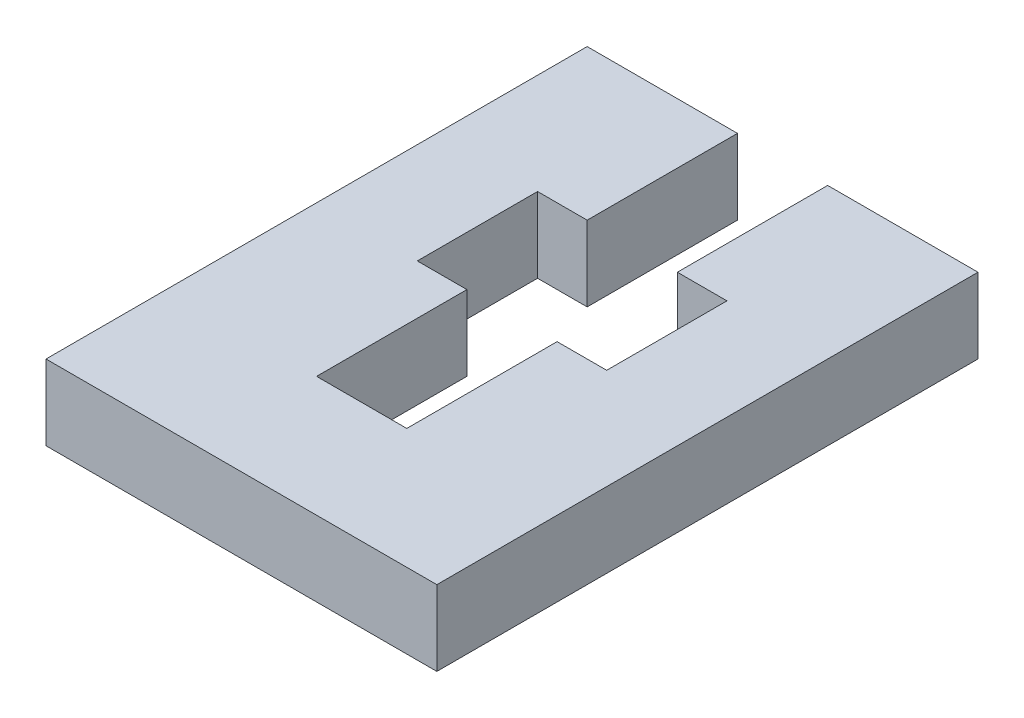
ISO-10303-21;
HEADER;
FILE_DESCRIPTION(('STEP AP214'),'2;1');
FILE_NAME('part.step','',(''),(''),'','','');
FILE_SCHEMA(('AUTOMOTIVE_DESIGN { 1 0 10303 214 1 1 1 1 }'));
ENDSEC;
DATA;
#1=APPLICATION_CONTEXT('core data for automotive mechanical design processes');
#2=APPLICATION_PROTOCOL_DEFINITION('international standard','automotive_design',2000,#1);
#3=PRODUCT_CONTEXT('',#1,'mechanical');
#4=PRODUCT('Part','Part','',(#3));
#5=PRODUCT_RELATED_PRODUCT_CATEGORY('part','',(#4));
#6=PRODUCT_DEFINITION_FORMATION('','',#4);
#7=PRODUCT_DEFINITION_CONTEXT('part definition',#1,'design');
#8=PRODUCT_DEFINITION('design','',#6,#7);
#9=PRODUCT_DEFINITION_SHAPE('','',#8);
#10=(LENGTH_UNIT() NAMED_UNIT(*) SI_UNIT(.MILLI.,.METRE.));
#11=(NAMED_UNIT(*) PLANE_ANGLE_UNIT() SI_UNIT($,.RADIAN.));
#12=(NAMED_UNIT(*) SI_UNIT($,.STERADIAN.) SOLID_ANGLE_UNIT());
#13=UNCERTAINTY_MEASURE_WITH_UNIT(LENGTH_MEASURE(1.E-05),#10,'distance_accuracy_value','');
#14=(GEOMETRIC_REPRESENTATION_CONTEXT(3) GLOBAL_UNCERTAINTY_ASSIGNED_CONTEXT((#13)) GLOBAL_UNIT_ASSIGNED_CONTEXT((#10,
#11,#12)) REPRESENTATION_CONTEXT('',''));
#15=CARTESIAN_POINT('',(0.,0.,0.));
#16=DIRECTION('',(0.,0.,1.));
#17=DIRECTION('',(1.,0.,0.));
#18=AXIS2_PLACEMENT_3D('',#15,#16,#17);
#19=CARTESIAN_POINT('',(6.5,2.5,-8.5));
#20=DIRECTION('',(0.,0.,1.));
#21=DIRECTION('',(1.,0.,0.));
#22=AXIS2_PLACEMENT_3D('',#19,#20,#21);
#23=PLANE('',#22);
#24=DIRECTION('',(-1.,0.,0.));
#25=VECTOR('',#24,1.);
#26=CARTESIAN_POINT('',(6.5,0.,-8.5));
#27=LINE('',#26,#25);
#28=CARTESIAN_POINT('',(6.5,0.,-8.5));
#29=VERTEX_POINT('',#28);
#30=CARTESIAN_POINT('',(1.5,0.,-8.5));
#31=VERTEX_POINT('',#30);
#32=EDGE_CURVE('E177',#29,#31,#27,.T.);
#33=ORIENTED_EDGE('',*,*,#32,.T.);
#34=DIRECTION('',(0.,-1.,0.));
#35=VECTOR('',#34,1.);
#36=CARTESIAN_POINT('',(1.5,2.5,-8.5));
#37=LINE('',#36,#35);
#38=CARTESIAN_POINT('',(1.5,2.5,-8.5));
#39=VERTEX_POINT('',#38);
#40=EDGE_CURVE('E11',#39,#31,#37,.T.);
#41=ORIENTED_EDGE('',*,*,#40,.F.);
#42=DIRECTION('',(-1.,0.,0.));
#43=VECTOR('',#42,1.);
#44=CARTESIAN_POINT('',(6.5,2.5,-8.5));
#45=LINE('',#44,#43);
#46=CARTESIAN_POINT('',(6.5,2.5,-8.5));
#47=VERTEX_POINT('',#46);
#48=EDGE_CURVE('E207',#47,#39,#45,.T.);
#49=ORIENTED_EDGE('',*,*,#48,.F.);
#50=DIRECTION('',(0.,-1.,0.));
#51=VECTOR('',#50,1.);
#52=CARTESIAN_POINT('',(6.5,2.5,-8.5));
#53=LINE('',#52,#51);
#54=EDGE_CURVE('E173',#47,#29,#53,.T.);
#55=ORIENTED_EDGE('',*,*,#54,.T.);
#56=EDGE_LOOP('',(#33,#41,#49,#55));
#57=FACE_BOUND('',#56,.T.);
#58=ADVANCED_FACE('F33',(#57),#23,.F.);
#59=CARTESIAN_POINT('',(1.5,2.5,-8.5));
#60=DIRECTION('',(1.,0.,0.));
#61=DIRECTION('',(0.,0.,-1.));
#62=AXIS2_PLACEMENT_3D('',#59,#60,#61);
#63=PLANE('',#62);
#64=DIRECTION('',(0.,0.,1.));
#65=VECTOR('',#64,1.);
#66=CARTESIAN_POINT('',(1.5,0.,-8.5));
#67=LINE('',#66,#65);
#68=CARTESIAN_POINT('',(1.5,0.,-3.5));
#69=VERTEX_POINT('',#68);
#70=EDGE_CURVE('E180',#31,#69,#67,.T.);
#71=ORIENTED_EDGE('',*,*,#70,.T.);
#72=DIRECTION('',(0.,-1.,0.));
#73=VECTOR('',#72,1.);
#74=CARTESIAN_POINT('',(1.5,2.5,-3.5));
#75=LINE('',#74,#73);
#76=CARTESIAN_POINT('',(1.5,2.5,-3.5));
#77=VERTEX_POINT('',#76);
#78=EDGE_CURVE('E41',#77,#69,#75,.T.);
#79=ORIENTED_EDGE('',*,*,#78,.F.);
#80=DIRECTION('',(0.,0.,1.));
#81=VECTOR('',#80,1.);
#82=CARTESIAN_POINT('',(1.5,2.5,-8.5));
#83=LINE('',#82,#81);
#84=EDGE_CURVE('E116',#39,#77,#83,.T.);
#85=ORIENTED_EDGE('',*,*,#84,.F.);
#86=ORIENTED_EDGE('',*,*,#40,.T.);
#87=EDGE_LOOP('',(#71,#79,#85,#86));
#88=FACE_BOUND('',#87,.T.);
#89=ADVANCED_FACE('F305',(#88),#63,.F.);
#90=CARTESIAN_POINT('',(1.5,2.5,-3.5));
#91=DIRECTION('',(0.,0.,-1.));
#92=DIRECTION('',(-1.,0.,0.));
#93=AXIS2_PLACEMENT_3D('',#90,#91,#92);
#94=PLANE('',#93);
#95=DIRECTION('',(1.,0.,0.));
#96=VECTOR('',#95,1.);
#97=CARTESIAN_POINT('',(1.5,0.,-3.5));
#98=LINE('',#97,#96);
#99=CARTESIAN_POINT('',(3.15,0.,-3.5));
#100=VERTEX_POINT('',#99);
#101=EDGE_CURVE('E182',#69,#100,#98,.T.);
#102=ORIENTED_EDGE('',*,*,#101,.T.);
#103=DIRECTION('',(0.,-1.,0.));
#104=VECTOR('',#103,1.);
#105=CARTESIAN_POINT('',(3.15,2.5,-3.5));
#106=LINE('',#105,#104);
#107=CARTESIAN_POINT('',(3.15,2.5,-3.5));
#108=VERTEX_POINT('',#107);
#109=EDGE_CURVE('E238',#108,#100,#106,.T.);
#110=ORIENTED_EDGE('',*,*,#109,.F.);
#111=DIRECTION('',(1.,0.,0.));
#112=VECTOR('',#111,1.);
#113=CARTESIAN_POINT('',(1.5,2.5,-3.5));
#114=LINE('',#113,#112);
#115=EDGE_CURVE('E246',#77,#108,#114,.T.);
#116=ORIENTED_EDGE('',*,*,#115,.F.);
#117=ORIENTED_EDGE('',*,*,#78,.T.);
#118=EDGE_LOOP('',(#102,#110,#116,#117));
#119=FACE_BOUND('',#118,.T.);
#120=ADVANCED_FACE('F244',(#119),#94,.F.);
#121=CARTESIAN_POINT('',(3.15,2.5,-3.5));
#122=DIRECTION('',(1.,0.,0.));
#123=DIRECTION('',(0.,0.,-1.));
#124=AXIS2_PLACEMENT_3D('',#121,#122,#123);
#125=PLANE('',#124);
#126=DIRECTION('',(0.,0.,1.));
#127=VECTOR('',#126,1.);
#128=CARTESIAN_POINT('',(3.15,0.,-3.5));
#129=LINE('',#128,#127);
#130=CARTESIAN_POINT('',(3.15,0.,0.5));
#131=VERTEX_POINT('',#130);
#132=EDGE_CURVE('E184',#100,#131,#129,.T.);
#133=ORIENTED_EDGE('',*,*,#132,.T.);
#134=DIRECTION('',(0.,-1.,0.));
#135=VECTOR('',#134,1.);
#136=CARTESIAN_POINT('',(3.15,2.5,0.5));
#137=LINE('',#136,#135);
#138=CARTESIAN_POINT('',(3.15,2.5,0.5));
#139=VERTEX_POINT('',#138);
#140=EDGE_CURVE('E235',#139,#131,#137,.T.);
#141=ORIENTED_EDGE('',*,*,#140,.F.);
#142=DIRECTION('',(0.,0.,1.));
#143=VECTOR('',#142,1.);
#144=CARTESIAN_POINT('',(3.15,2.5,-3.5));
#145=LINE('',#144,#143);
#146=EDGE_CURVE('E264',#108,#139,#145,.T.);
#147=ORIENTED_EDGE('',*,*,#146,.F.);
#148=ORIENTED_EDGE('',*,*,#109,.T.);
#149=EDGE_LOOP('',(#133,#141,#147,#148));
#150=FACE_BOUND('',#149,.T.);
#151=ADVANCED_FACE('F255',(#150),#125,.F.);
#152=CARTESIAN_POINT('',(3.15,2.5,0.5));
#153=DIRECTION('',(0.,0.,1.));
#154=DIRECTION('',(1.,0.,0.));
#155=AXIS2_PLACEMENT_3D('',#152,#153,#154);
#156=PLANE('',#155);
#157=DIRECTION('',(-1.,0.,0.));
#158=VECTOR('',#157,1.);
#159=CARTESIAN_POINT('',(3.15,0.,0.5));
#160=LINE('',#159,#158);
#161=CARTESIAN_POINT('',(1.5,0.,0.5));
#162=VERTEX_POINT('',#161);
#163=EDGE_CURVE('E186',#131,#162,#160,.T.);
#164=ORIENTED_EDGE('',*,*,#163,.T.);
#165=DIRECTION('',(0.,-1.,0.));
#166=VECTOR('',#165,1.);
#167=CARTESIAN_POINT('',(1.5,2.5,0.5));
#168=LINE('',#167,#166);
#169=CARTESIAN_POINT('',(1.5,2.5,0.5));
#170=VERTEX_POINT('',#169);
#171=EDGE_CURVE('E232',#170,#162,#168,.T.);
#172=ORIENTED_EDGE('',*,*,#171,.F.);
#173=DIRECTION('',(-1.,0.,0.));
#174=VECTOR('',#173,1.);
#175=CARTESIAN_POINT('',(3.15,2.5,0.5));
#176=LINE('',#175,#174);
#177=EDGE_CURVE('E261',#139,#170,#176,.T.);
#178=ORIENTED_EDGE('',*,*,#177,.F.);
#179=ORIENTED_EDGE('',*,*,#140,.T.);
#180=EDGE_LOOP('',(#164,#172,#178,#179));
#181=FACE_BOUND('',#180,.T.);
#182=ADVANCED_FACE('F259',(#181),#156,.F.);
#183=CARTESIAN_POINT('',(1.5,2.5,0.5));
#184=DIRECTION('',(1.,0.,0.));
#185=DIRECTION('',(0.,0.,-1.));
#186=AXIS2_PLACEMENT_3D('',#183,#184,#185);
#187=PLANE('',#186);
#188=DIRECTION('',(0.,0.,1.));
#189=VECTOR('',#188,1.);
#190=CARTESIAN_POINT('',(1.5,0.,0.5));
#191=LINE('',#190,#189);
#192=CARTESIAN_POINT('',(1.5,0.,5.5));
#193=VERTEX_POINT('',#192);
#194=EDGE_CURVE('E188',#162,#193,#191,.T.);
#195=ORIENTED_EDGE('',*,*,#194,.T.);
#196=DIRECTION('',(0.,-1.,0.));
#197=VECTOR('',#196,1.);
#198=CARTESIAN_POINT('',(1.5,2.5,5.5));
#199=LINE('',#198,#197);
#200=CARTESIAN_POINT('',(1.5,2.5,5.5));
#201=VERTEX_POINT('',#200);
#202=EDGE_CURVE('E229',#201,#193,#199,.T.);
#203=ORIENTED_EDGE('',*,*,#202,.F.);
#204=DIRECTION('',(0.,0.,1.));
#205=VECTOR('',#204,1.);
#206=CARTESIAN_POINT('',(1.5,2.5,0.5));
#207=LINE('',#206,#205);
#208=EDGE_CURVE('E263',#170,#201,#207,.T.);
#209=ORIENTED_EDGE('',*,*,#208,.F.);
#210=ORIENTED_EDGE('',*,*,#171,.T.);
#211=EDGE_LOOP('',(#195,#203,#209,#210));
#212=FACE_BOUND('',#211,.T.);
#213=ADVANCED_FACE('F318',(#212),#187,.F.);
#214=CARTESIAN_POINT('',(1.5,2.5,5.5));
#215=DIRECTION('',(0.,0.,1.));
#216=DIRECTION('',(1.,0.,0.));
#217=AXIS2_PLACEMENT_3D('',#214,#215,#216);
#218=PLANE('',#217);
#219=DIRECTION('',(-1.,0.,0.));
#220=VECTOR('',#219,1.);
#221=CARTESIAN_POINT('',(1.5,0.,5.5));
#222=LINE('',#221,#220);
#223=CARTESIAN_POINT('',(-1.5,0.,5.5));
#224=VERTEX_POINT('',#223);
#225=EDGE_CURVE('E190',#193,#224,#222,.T.);
#226=ORIENTED_EDGE('',*,*,#225,.T.);
#227=DIRECTION('',(0.,-1.,0.));
#228=VECTOR('',#227,1.);
#229=CARTESIAN_POINT('',(-1.5,2.5,5.5));
#230=LINE('',#229,#228);
#231=CARTESIAN_POINT('',(-1.5,2.5,5.5));
#232=VERTEX_POINT('',#231);
#233=EDGE_CURVE('E226',#232,#224,#230,.T.);
#234=ORIENTED_EDGE('',*,*,#233,.F.);
#235=DIRECTION('',(-1.,0.,0.));
#236=VECTOR('',#235,1.);
#237=CARTESIAN_POINT('',(1.5,2.5,5.5));
#238=LINE('',#237,#236);
#239=EDGE_CURVE('E266',#201,#232,#238,.T.);
#240=ORIENTED_EDGE('',*,*,#239,.F.);
#241=ORIENTED_EDGE('',*,*,#202,.T.);
#242=EDGE_LOOP('',(#226,#234,#240,#241));
#243=FACE_BOUND('',#242,.T.);
#244=ADVANCED_FACE('F321',(#243),#218,.F.);
#245=CARTESIAN_POINT('',(-1.5,2.5,5.5));
#246=DIRECTION('',(-1.,0.,0.));
#247=DIRECTION('',(0.,0.,1.));
#248=AXIS2_PLACEMENT_3D('',#245,#246,#247);
#249=PLANE('',#248);
#250=DIRECTION('',(0.,0.,-1.));
#251=VECTOR('',#250,1.);
#252=CARTESIAN_POINT('',(-1.5,0.,5.5));
#253=LINE('',#252,#251);
#254=CARTESIAN_POINT('',(-1.5,0.,0.5));
#255=VERTEX_POINT('',#254);
#256=EDGE_CURVE('E192',#224,#255,#253,.T.);
#257=ORIENTED_EDGE('',*,*,#256,.T.);
#258=DIRECTION('',(0.,-1.,0.));
#259=VECTOR('',#258,1.);
#260=CARTESIAN_POINT('',(-1.5,2.5,0.5));
#261=LINE('',#260,#259);
#262=CARTESIAN_POINT('',(-1.5,2.5,0.5));
#263=VERTEX_POINT('',#262);
#264=EDGE_CURVE('E223',#263,#255,#261,.T.);
#265=ORIENTED_EDGE('',*,*,#264,.F.);
#266=DIRECTION('',(0.,0.,-1.));
#267=VECTOR('',#266,1.);
#268=CARTESIAN_POINT('',(-1.5,2.5,5.5));
#269=LINE('',#268,#267);
#270=EDGE_CURVE('E272',#232,#263,#269,.T.);
#271=ORIENTED_EDGE('',*,*,#270,.F.);
#272=ORIENTED_EDGE('',*,*,#233,.T.);
#273=EDGE_LOOP('',(#257,#265,#271,#272));
#274=FACE_BOUND('',#273,.T.);
#275=ADVANCED_FACE('F325',(#274),#249,.F.);
#276=CARTESIAN_POINT('',(-1.5,2.5,0.5));
#277=DIRECTION('',(0.,0.,1.));
#278=DIRECTION('',(1.,0.,0.));
#279=AXIS2_PLACEMENT_3D('',#276,#277,#278);
#280=PLANE('',#279);
#281=DIRECTION('',(-1.,0.,0.));
#282=VECTOR('',#281,1.);
#283=CARTESIAN_POINT('',(-1.5,0.,0.5));
#284=LINE('',#283,#282);
#285=CARTESIAN_POINT('',(-3.15,0.,0.5));
#286=VERTEX_POINT('',#285);
#287=EDGE_CURVE('E194',#255,#286,#284,.T.);
#288=ORIENTED_EDGE('',*,*,#287,.T.);
#289=DIRECTION('',(0.,-1.,0.));
#290=VECTOR('',#289,1.);
#291=CARTESIAN_POINT('',(-3.15,2.5,0.5));
#292=LINE('',#291,#290);
#293=CARTESIAN_POINT('',(-3.15,2.5,0.5));
#294=VERTEX_POINT('',#293);
#295=EDGE_CURVE('E220',#294,#286,#292,.T.);
#296=ORIENTED_EDGE('',*,*,#295,.F.);
#297=DIRECTION('',(-1.,0.,0.));
#298=VECTOR('',#297,1.);
#299=CARTESIAN_POINT('',(-1.5,2.5,0.5));
#300=LINE('',#299,#298);
#301=EDGE_CURVE('E274',#263,#294,#300,.T.);
#302=ORIENTED_EDGE('',*,*,#301,.F.);
#303=ORIENTED_EDGE('',*,*,#264,.T.);
#304=EDGE_LOOP('',(#288,#296,#302,#303));
#305=FACE_BOUND('',#304,.T.);
#306=ADVANCED_FACE('F329',(#305),#280,.F.);
#307=CARTESIAN_POINT('',(-3.15,2.5,0.5));
#308=DIRECTION('',(-1.,0.,0.));
#309=DIRECTION('',(0.,0.,1.));
#310=AXIS2_PLACEMENT_3D('',#307,#308,#309);
#311=PLANE('',#310);
#312=DIRECTION('',(0.,0.,-1.));
#313=VECTOR('',#312,1.);
#314=CARTESIAN_POINT('',(-3.15,0.,0.5));
#315=LINE('',#314,#313);
#316=CARTESIAN_POINT('',(-3.15,0.,-3.5));
#317=VERTEX_POINT('',#316);
#318=EDGE_CURVE('E196',#286,#317,#315,.T.);
#319=ORIENTED_EDGE('',*,*,#318,.T.);
#320=DIRECTION('',(0.,-1.,0.));
#321=VECTOR('',#320,1.);
#322=CARTESIAN_POINT('',(-3.15,2.5,-3.5));
#323=LINE('',#322,#321);
#324=CARTESIAN_POINT('',(-3.15,2.5,-3.5));
#325=VERTEX_POINT('',#324);
#326=EDGE_CURVE('E217',#325,#317,#323,.T.);
#327=ORIENTED_EDGE('',*,*,#326,.F.);
#328=DIRECTION('',(0.,0.,-1.));
#329=VECTOR('',#328,1.);
#330=CARTESIAN_POINT('',(-3.15,2.5,0.5));
#331=LINE('',#330,#329);
#332=EDGE_CURVE('E276',#294,#325,#331,.T.);
#333=ORIENTED_EDGE('',*,*,#332,.F.);
#334=ORIENTED_EDGE('',*,*,#295,.T.);
#335=EDGE_LOOP('',(#319,#327,#333,#334));
#336=FACE_BOUND('',#335,.T.);
#337=ADVANCED_FACE('F333',(#336),#311,.F.);
#338=CARTESIAN_POINT('',(-3.15,2.5,-3.5));
#339=DIRECTION('',(0.,0.,-1.));
#340=DIRECTION('',(-1.,0.,0.));
#341=AXIS2_PLACEMENT_3D('',#338,#339,#340);
#342=PLANE('',#341);
#343=DIRECTION('',(1.,0.,0.));
#344=VECTOR('',#343,1.);
#345=CARTESIAN_POINT('',(-3.15,0.,-3.5));
#346=LINE('',#345,#344);
#347=CARTESIAN_POINT('',(-1.5,0.,-3.5));
#348=VERTEX_POINT('',#347);
#349=EDGE_CURVE('E198',#317,#348,#346,.T.);
#350=ORIENTED_EDGE('',*,*,#349,.T.);
#351=DIRECTION('',(0.,-1.,0.));
#352=VECTOR('',#351,1.);
#353=CARTESIAN_POINT('',(-1.5,2.5,-3.5));
#354=LINE('',#353,#352);
#355=CARTESIAN_POINT('',(-1.5,2.5,-3.5));
#356=VERTEX_POINT('',#355);
#357=EDGE_CURVE('E214',#356,#348,#354,.T.);
#358=ORIENTED_EDGE('',*,*,#357,.F.);
#359=DIRECTION('',(1.,0.,0.));
#360=VECTOR('',#359,1.);
#361=CARTESIAN_POINT('',(-3.15,2.5,-3.5));
#362=LINE('',#361,#360);
#363=EDGE_CURVE('E278',#325,#356,#362,.T.);
#364=ORIENTED_EDGE('',*,*,#363,.F.);
#365=ORIENTED_EDGE('',*,*,#326,.T.);
#366=EDGE_LOOP('',(#350,#358,#364,#365));
#367=FACE_BOUND('',#366,.T.);
#368=ADVANCED_FACE('F337',(#367),#342,.F.);
#369=CARTESIAN_POINT('',(-1.5,2.5,-3.5));
#370=DIRECTION('',(-1.,0.,0.));
#371=DIRECTION('',(0.,0.,1.));
#372=AXIS2_PLACEMENT_3D('',#369,#370,#371);
#373=PLANE('',#372);
#374=DIRECTION('',(0.,0.,-1.));
#375=VECTOR('',#374,1.);
#376=CARTESIAN_POINT('',(-1.5,0.,-3.5));
#377=LINE('',#376,#375);
#378=CARTESIAN_POINT('',(-1.5,0.,-8.5));
#379=VERTEX_POINT('',#378);
#380=EDGE_CURVE('E200',#348,#379,#377,.T.);
#381=ORIENTED_EDGE('',*,*,#380,.T.);
#382=DIRECTION('',(0.,-1.,0.));
#383=VECTOR('',#382,1.);
#384=CARTESIAN_POINT('',(-1.5,2.5,-8.5));
#385=LINE('',#384,#383);
#386=CARTESIAN_POINT('',(-1.5,2.5,-8.5));
#387=VERTEX_POINT('',#386);
#388=EDGE_CURVE('E211',#387,#379,#385,.T.);
#389=ORIENTED_EDGE('',*,*,#388,.F.);
#390=DIRECTION('',(0.,0.,-1.));
#391=VECTOR('',#390,1.);
#392=CARTESIAN_POINT('',(-1.5,2.5,-3.5));
#393=LINE('',#392,#391);
#394=EDGE_CURVE('E280',#356,#387,#393,.T.);
#395=ORIENTED_EDGE('',*,*,#394,.F.);
#396=ORIENTED_EDGE('',*,*,#357,.T.);
#397=EDGE_LOOP('',(#381,#389,#395,#396));
#398=FACE_BOUND('',#397,.T.);
#399=ADVANCED_FACE('F286',(#398),#373,.F.);
#400=CARTESIAN_POINT('',(-1.5,2.5,-8.5));
#401=DIRECTION('',(0.,0.,1.));
#402=DIRECTION('',(1.,0.,0.));
#403=AXIS2_PLACEMENT_3D('',#400,#401,#402);
#404=PLANE('',#403);
#405=DIRECTION('',(-1.,0.,0.));
#406=VECTOR('',#405,1.);
#407=CARTESIAN_POINT('',(-1.5,0.,-8.5));
#408=LINE('',#407,#406);
#409=CARTESIAN_POINT('',(-6.5,0.,-8.5));
#410=VERTEX_POINT('',#409);
#411=EDGE_CURVE('E202',#379,#410,#408,.T.);
#412=ORIENTED_EDGE('',*,*,#411,.T.);
#413=DIRECTION('',(0.,-1.,0.));
#414=VECTOR('',#413,1.);
#415=CARTESIAN_POINT('',(-6.5,2.5,-8.5));
#416=LINE('',#415,#414);
#417=CARTESIAN_POINT('',(-6.5,2.5,-8.5));
#418=VERTEX_POINT('',#417);
#419=EDGE_CURVE('E168',#418,#410,#416,.T.);
#420=ORIENTED_EDGE('',*,*,#419,.F.);
#421=DIRECTION('',(-1.,0.,0.));
#422=VECTOR('',#421,1.);
#423=CARTESIAN_POINT('',(-1.5,2.5,-8.5));
#424=LINE('',#423,#422);
#425=EDGE_CURVE('E159',#387,#418,#424,.T.);
#426=ORIENTED_EDGE('',*,*,#425,.F.);
#427=ORIENTED_EDGE('',*,*,#388,.T.);
#428=EDGE_LOOP('',(#412,#420,#426,#427));
#429=FACE_BOUND('',#428,.T.);
#430=ADVANCED_FACE('F290',(#429),#404,.F.);
#431=CARTESIAN_POINT('',(-6.5,2.5,-8.5));
#432=DIRECTION('',(1.,0.,0.));
#433=DIRECTION('',(0.,0.,-1.));
#434=AXIS2_PLACEMENT_3D('',#431,#432,#433);
#435=PLANE('',#434);
#436=DIRECTION('',(0.,0.,1.));
#437=VECTOR('',#436,1.);
#438=CARTESIAN_POINT('',(-6.5,0.,-8.5));
#439=LINE('',#438,#437);
#440=CARTESIAN_POINT('',(-6.5,0.,9.5));
#441=VERTEX_POINT('',#440);
#442=EDGE_CURVE('E167',#410,#441,#439,.T.);
#443=ORIENTED_EDGE('',*,*,#442,.T.);
#444=DIRECTION('',(0.,-1.,0.));
#445=VECTOR('',#444,1.);
#446=CARTESIAN_POINT('',(-6.5,2.5,9.5));
#447=LINE('',#446,#445);
#448=CARTESIAN_POINT('',(-6.5,2.5,9.5));
#449=VERTEX_POINT('',#448);
#450=EDGE_CURVE('E164',#449,#441,#447,.T.);
#451=ORIENTED_EDGE('',*,*,#450,.F.);
#452=DIRECTION('',(0.,0.,1.));
#453=VECTOR('',#452,1.);
#454=CARTESIAN_POINT('',(-6.5,2.5,-8.5));
#455=LINE('',#454,#453);
#456=EDGE_CURVE('E153',#418,#449,#455,.T.);
#457=ORIENTED_EDGE('',*,*,#456,.F.);
#458=ORIENTED_EDGE('',*,*,#419,.T.);
#459=EDGE_LOOP('',(#443,#451,#457,#458));
#460=FACE_BOUND('',#459,.T.);
#461=ADVANCED_FACE('F165',(#460),#435,.F.);
#462=CARTESIAN_POINT('',(-6.5,2.5,9.5));
#463=DIRECTION('',(0.,0.,-1.));
#464=DIRECTION('',(-1.,0.,0.));
#465=AXIS2_PLACEMENT_3D('',#462,#463,#464);
#466=PLANE('',#465);
#467=DIRECTION('',(1.,0.,0.));
#468=VECTOR('',#467,1.);
#469=CARTESIAN_POINT('',(-6.5,0.,9.5));
#470=LINE('',#469,#468);
#471=CARTESIAN_POINT('',(6.5,0.,9.5));
#472=VERTEX_POINT('',#471);
#473=EDGE_CURVE('E102',#441,#472,#470,.T.);
#474=ORIENTED_EDGE('',*,*,#473,.T.);
#475=DIRECTION('',(0.,-1.,0.));
#476=VECTOR('',#475,1.);
#477=CARTESIAN_POINT('',(6.5,2.5,9.5));
#478=LINE('',#477,#476);
#479=CARTESIAN_POINT('',(6.5,2.5,9.5));
#480=VERTEX_POINT('',#479);
#481=EDGE_CURVE('E169',#480,#472,#478,.T.);
#482=ORIENTED_EDGE('',*,*,#481,.F.);
#483=DIRECTION('',(1.,0.,0.));
#484=VECTOR('',#483,1.);
#485=CARTESIAN_POINT('',(-6.5,2.5,9.5));
#486=LINE('',#485,#484);
#487=EDGE_CURVE('E157',#449,#480,#486,.T.);
#488=ORIENTED_EDGE('',*,*,#487,.F.);
#489=ORIENTED_EDGE('',*,*,#450,.T.);
#490=EDGE_LOOP('',(#474,#482,#488,#489));
#491=FACE_BOUND('',#490,.T.);
#492=ADVANCED_FACE('F171',(#491),#466,.F.);
#493=CARTESIAN_POINT('',(6.5,2.5,9.5));
#494=DIRECTION('',(-1.,0.,0.));
#495=DIRECTION('',(0.,0.,1.));
#496=AXIS2_PLACEMENT_3D('',#493,#494,#495);
#497=PLANE('',#496);
#498=DIRECTION('',(0.,0.,-1.));
#499=VECTOR('',#498,1.);
#500=CARTESIAN_POINT('',(6.5,0.,9.5));
#501=LINE('',#500,#499);
#502=EDGE_CURVE('E108',#472,#29,#501,.T.);
#503=ORIENTED_EDGE('',*,*,#502,.T.);
#504=ORIENTED_EDGE('',*,*,#54,.F.);
#505=DIRECTION('',(0.,0.,-1.));
#506=VECTOR('',#505,1.);
#507=CARTESIAN_POINT('',(6.5,2.5,9.5));
#508=LINE('',#507,#506);
#509=EDGE_CURVE('E49',#480,#47,#508,.T.);
#510=ORIENTED_EDGE('',*,*,#509,.F.);
#511=ORIENTED_EDGE('',*,*,#481,.T.);
#512=EDGE_LOOP('',(#503,#504,#510,#511));
#513=FACE_BOUND('',#512,.T.);
#514=ADVANCED_FACE('F294',(#513),#497,.F.);
#515=CARTESIAN_POINT('',(0.,2.5,0.));
#516=DIRECTION('',(0.,1.,0.));
#517=DIRECTION('',(0.,0.,1.));
#518=AXIS2_PLACEMENT_3D('',#515,#516,#517);
#519=PLANE('',#518);
#520=ORIENTED_EDGE('',*,*,#48,.T.);
#521=ORIENTED_EDGE('',*,*,#84,.T.);
#522=ORIENTED_EDGE('',*,*,#115,.T.);
#523=ORIENTED_EDGE('',*,*,#146,.T.);
#524=ORIENTED_EDGE('',*,*,#177,.T.);
#525=ORIENTED_EDGE('',*,*,#208,.T.);
#526=ORIENTED_EDGE('',*,*,#239,.T.);
#527=ORIENTED_EDGE('',*,*,#270,.T.);
#528=ORIENTED_EDGE('',*,*,#301,.T.);
#529=ORIENTED_EDGE('',*,*,#332,.T.);
#530=ORIENTED_EDGE('',*,*,#363,.T.);
#531=ORIENTED_EDGE('',*,*,#394,.T.);
#532=ORIENTED_EDGE('',*,*,#425,.T.);
#533=ORIENTED_EDGE('',*,*,#456,.T.);
#534=ORIENTED_EDGE('',*,*,#487,.T.);
#535=ORIENTED_EDGE('',*,*,#509,.T.);
#536=EDGE_LOOP('',(#520,#521,#522,#523,#524,#525,#526,#527,#528,#529,#530,#531,#532,#533,#534,#535));
#537=FACE_BOUND('',#536,.T.);
#538=ADVANCED_FACE('F155',(#537),#519,.T.);
#539=CARTESIAN_POINT('',(0.,0.,0.));
#540=DIRECTION('',(0.,1.,0.));
#541=DIRECTION('',(0.,0.,1.));
#542=AXIS2_PLACEMENT_3D('',#539,#540,#541);
#543=PLANE('',#542);
#544=ORIENTED_EDGE('',*,*,#32,.F.);
#545=ORIENTED_EDGE('',*,*,#502,.F.);
#546=ORIENTED_EDGE('',*,*,#473,.F.);
#547=ORIENTED_EDGE('',*,*,#442,.F.);
#548=ORIENTED_EDGE('',*,*,#411,.F.);
#549=ORIENTED_EDGE('',*,*,#380,.F.);
#550=ORIENTED_EDGE('',*,*,#349,.F.);
#551=ORIENTED_EDGE('',*,*,#318,.F.);
#552=ORIENTED_EDGE('',*,*,#287,.F.);
#553=ORIENTED_EDGE('',*,*,#256,.F.);
#554=ORIENTED_EDGE('',*,*,#225,.F.);
#555=ORIENTED_EDGE('',*,*,#194,.F.);
#556=ORIENTED_EDGE('',*,*,#163,.F.);
#557=ORIENTED_EDGE('',*,*,#132,.F.);
#558=ORIENTED_EDGE('',*,*,#101,.F.);
#559=ORIENTED_EDGE('',*,*,#70,.F.);
#560=EDGE_LOOP('',(#544,#545,#546,#547,#548,#549,#550,#551,#552,#553,#554,#555,#556,#557,#558,#559));
#561=FACE_BOUND('',#560,.T.);
#562=ADVANCED_FACE('F250',(#561),#543,.F.);
#563=CLOSED_SHELL('',(#58,#89,#120,#151,#182,#213,#244,#275,#306,#337,#368,#399,#430,#461,#492,
#514,#538,#562));
#564=MANIFOLD_SOLID_BREP('B2',#563);
#565=ADVANCED_BREP_SHAPE_REPRESENTATION('',(#18,#564),#14);
#566=SHAPE_DEFINITION_REPRESENTATION(#9,#565);
ENDSEC;
END-ISO-10303-21;
